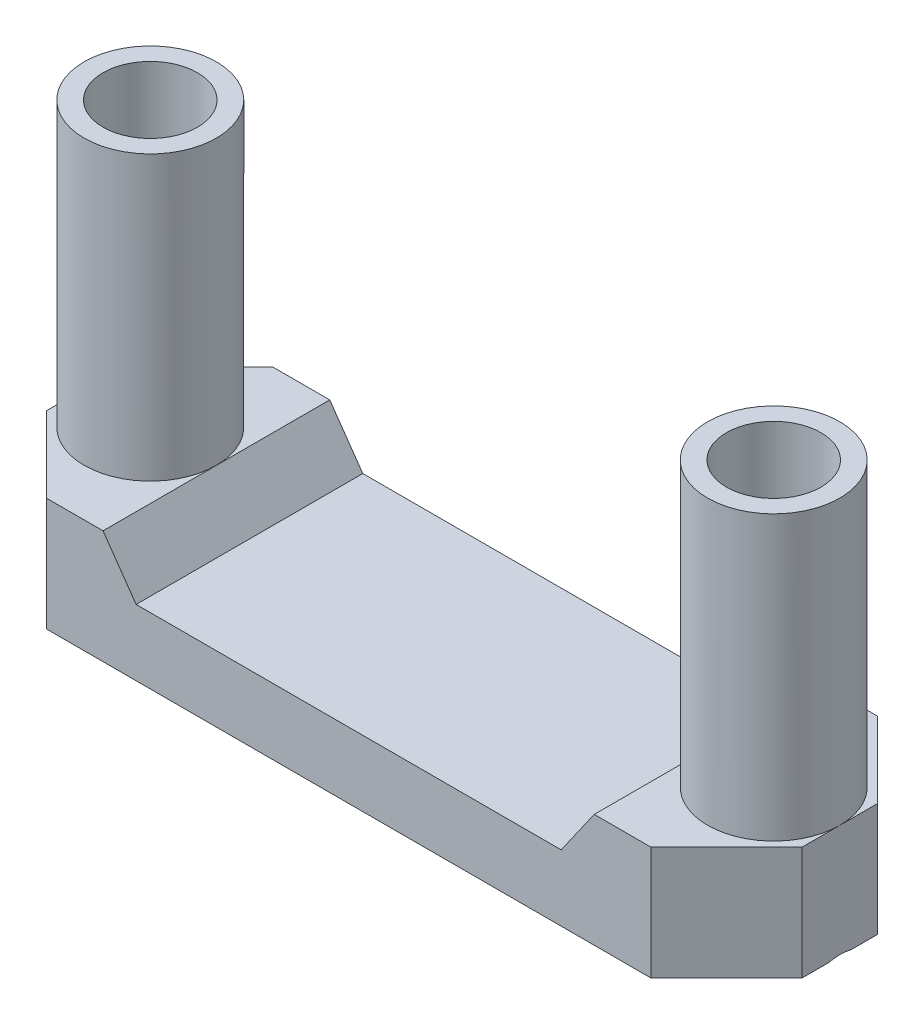
ISO-10303-21;
HEADER;
FILE_DESCRIPTION(('STEP AP214'),'2;1');
FILE_NAME('part.step','',(''),(''),'','','');
FILE_SCHEMA(('AUTOMOTIVE_DESIGN { 1 0 10303 214 1 1 1 1 }'));
ENDSEC;
DATA;
#1=APPLICATION_CONTEXT('core data for automotive mechanical design processes');
#2=APPLICATION_PROTOCOL_DEFINITION('international standard','automotive_design',2000,#1);
#3=PRODUCT_CONTEXT('',#1,'mechanical');
#4=PRODUCT('Part','Part','',(#3));
#5=PRODUCT_RELATED_PRODUCT_CATEGORY('part','',(#4));
#6=PRODUCT_DEFINITION_FORMATION('','',#4);
#7=PRODUCT_DEFINITION_CONTEXT('part definition',#1,'design');
#8=PRODUCT_DEFINITION('design','',#6,#7);
#9=PRODUCT_DEFINITION_SHAPE('','',#8);
#10=(LENGTH_UNIT() NAMED_UNIT(*) SI_UNIT(.MILLI.,.METRE.));
#11=(NAMED_UNIT(*) PLANE_ANGLE_UNIT() SI_UNIT($,.RADIAN.));
#12=(NAMED_UNIT(*) SI_UNIT($,.STERADIAN.) SOLID_ANGLE_UNIT());
#13=UNCERTAINTY_MEASURE_WITH_UNIT(LENGTH_MEASURE(1.E-05),#10,'distance_accuracy_value','');
#14=(GEOMETRIC_REPRESENTATION_CONTEXT(3) GLOBAL_UNCERTAINTY_ASSIGNED_CONTEXT((#13)) GLOBAL_UNIT_ASSIGNED_CONTEXT((#10,
#11,#12)) REPRESENTATION_CONTEXT('',''));
#15=CARTESIAN_POINT('',(0.,0.,0.));
#16=DIRECTION('',(0.,0.,1.));
#17=DIRECTION('',(1.,0.,0.));
#18=AXIS2_PLACEMENT_3D('',#15,#16,#17);
#19=CARTESIAN_POINT('',(0.,3.,0.));
#20=DIRECTION('',(0.,-1.,0.));
#21=DIRECTION('',(0.,0.,-1.));
#22=AXIS2_PLACEMENT_3D('',#19,#20,#21);
#23=PLANE('',#22);
#24=DIRECTION('',(0.,0.,-1.));
#25=VECTOR('',#24,1.);
#26=CARTESIAN_POINT('',(10.,3.,3.));
#27=LINE('',#26,#25);
#28=CARTESIAN_POINT('',(10.,3.,1.));
#29=VERTEX_POINT('',#28);
#30=CARTESIAN_POINT('',(10.,3.,0.));
#31=VERTEX_POINT('',#30);
#32=EDGE_CURVE('E176',#29,#31,#27,.T.);
#33=ORIENTED_EDGE('',*,*,#32,.T.);
#34=CARTESIAN_POINT('',(8.24999999999999,3.,0.));
#35=DIRECTION('',(0.,-1.,0.));
#36=DIRECTION('',(0.,0.,1.));
#37=AXIS2_PLACEMENT_3D('',#34,#35,#36);
#38=CIRCLE('',#37,1.75);
#39=CARTESIAN_POINT('',(6.5,3.,0.));
#40=VERTEX_POINT('',#39);
#41=EDGE_CURVE('E163',#31,#40,#38,.T.);
#42=ORIENTED_EDGE('',*,*,#41,.T.);
#43=DIRECTION('',(0.,0.,-1.));
#44=VECTOR('',#43,1.);
#45=CARTESIAN_POINT('',(6.5,3.,3.));
#46=LINE('',#45,#44);
#47=CARTESIAN_POINT('',(6.5,3.,3.));
#48=VERTEX_POINT('',#47);
#49=EDGE_CURVE('E174',#48,#40,#46,.T.);
#50=ORIENTED_EDGE('',*,*,#49,.F.);
#51=DIRECTION('',(1.,0.,0.));
#52=VECTOR('',#51,1.);
#53=CARTESIAN_POINT('',(-9.99999999999999,3.,3.));
#54=LINE('',#53,#52);
#55=CARTESIAN_POINT('',(8.,3.,3.));
#56=VERTEX_POINT('',#55);
#57=EDGE_CURVE('E213',#48,#56,#54,.T.);
#58=ORIENTED_EDGE('',*,*,#57,.T.);
#59=DIRECTION('',(-0.707106781186549,0.,0.707106781186546));
#60=VECTOR('',#59,1.);
#61=CARTESIAN_POINT('',(10.,3.,1.));
#62=LINE('',#61,#60);
#63=EDGE_CURVE('E265',#56,#29,#62,.F.);
#64=ORIENTED_EDGE('',*,*,#63,.T.);
#65=EDGE_LOOP('',(#33,#42,#50,#58,#64));
#66=FACE_BOUND('',#65,.T.);
#67=ADVANCED_FACE('F45',(#66),#23,.F.);
#68=CARTESIAN_POINT('',(-8.24999999999999,3.,0.));
#69=DIRECTION('',(0.,1.,0.));
#70=DIRECTION('',(0.,0.,1.));
#71=AXIS2_PLACEMENT_3D('',#68,#69,#70);
#72=CIRCLE('',#71,1.75);
#73=CARTESIAN_POINT('',(-9.99999999999999,3.,0.));
#74=VERTEX_POINT('',#73);
#75=CARTESIAN_POINT('',(-6.5,3.,0.));
#76=VERTEX_POINT('',#75);
#77=EDGE_CURVE('E385',#74,#76,#72,.T.);
#78=ORIENTED_EDGE('',*,*,#77,.F.);
#79=DIRECTION('',(0.,0.,1.));
#80=VECTOR('',#79,1.);
#81=CARTESIAN_POINT('',(-9.99999999999999,3.,3.));
#82=LINE('',#81,#80);
#83=CARTESIAN_POINT('',(-9.99999999999999,3.,0.999999999999991));
#84=VERTEX_POINT('',#83);
#85=EDGE_CURVE('E209',#74,#84,#82,.T.);
#86=ORIENTED_EDGE('',*,*,#85,.T.);
#87=DIRECTION('',(-0.707106781186546,0.,-0.707106781186549));
#88=VECTOR('',#87,1.);
#89=CARTESIAN_POINT('',(-7.99999999999999,3.,3.));
#90=LINE('',#89,#88);
#91=CARTESIAN_POINT('',(-7.99999999999999,3.,3.));
#92=VERTEX_POINT('',#91);
#93=EDGE_CURVE('E286',#84,#92,#90,.F.);
#94=ORIENTED_EDGE('',*,*,#93,.T.);
#95=CARTESIAN_POINT('',(-6.5,3.,3.));
#96=VERTEX_POINT('',#95);
#97=EDGE_CURVE('E214',#92,#96,#54,.T.);
#98=ORIENTED_EDGE('',*,*,#97,.T.);
#99=DIRECTION('',(0.,0.,1.));
#100=VECTOR('',#99,1.);
#101=CARTESIAN_POINT('',(-6.5,3.,3.));
#102=LINE('',#101,#100);
#103=EDGE_CURVE('E192',#76,#96,#102,.T.);
#104=ORIENTED_EDGE('',*,*,#103,.F.);
#105=EDGE_LOOP('',(#78,#86,#94,#98,#104));
#106=FACE_BOUND('',#105,.T.);
#107=ADVANCED_FACE('F361',(#106),#23,.F.);
#108=EDGE_CURVE('E376',#76,#74,#72,.T.);
#109=ORIENTED_EDGE('',*,*,#108,.F.);
#110=CARTESIAN_POINT('',(-6.5,3.,-3.));
#111=VERTEX_POINT('',#110);
#112=EDGE_CURVE('E194',#111,#76,#102,.T.);
#113=ORIENTED_EDGE('',*,*,#112,.F.);
#114=DIRECTION('',(-1.,0.,0.));
#115=VECTOR('',#114,1.);
#116=CARTESIAN_POINT('',(-9.99999999999999,3.,-3.));
#117=LINE('',#116,#115);
#118=CARTESIAN_POINT('',(-7.99999999999999,3.,-3.));
#119=VERTEX_POINT('',#118);
#120=EDGE_CURVE('E205',#111,#119,#117,.T.);
#121=ORIENTED_EDGE('',*,*,#120,.T.);
#122=DIRECTION('',(0.707106781186549,0.,-0.707106781186546));
#123=VECTOR('',#122,1.);
#124=CARTESIAN_POINT('',(-9.99999999999999,3.,-1.));
#125=LINE('',#124,#123);
#126=CARTESIAN_POINT('',(-9.99999999999999,3.,-1.));
#127=VERTEX_POINT('',#126);
#128=EDGE_CURVE('E289',#119,#127,#125,.F.);
#129=ORIENTED_EDGE('',*,*,#128,.T.);
#130=EDGE_CURVE('E210',#127,#74,#82,.T.);
#131=ORIENTED_EDGE('',*,*,#130,.T.);
#132=EDGE_LOOP('',(#109,#113,#121,#129,#131));
#133=FACE_BOUND('',#132,.T.);
#134=ADVANCED_FACE('F363',(#133),#23,.F.);
#135=CARTESIAN_POINT('',(6.5,3.,-3.));
#136=VERTEX_POINT('',#135);
#137=EDGE_CURVE('E181',#40,#136,#46,.T.);
#138=ORIENTED_EDGE('',*,*,#137,.F.);
#139=EDGE_CURVE('E160',#40,#31,#38,.T.);
#140=ORIENTED_EDGE('',*,*,#139,.T.);
#141=CARTESIAN_POINT('',(10.,3.,-0.999999999999995));
#142=VERTEX_POINT('',#141);
#143=EDGE_CURVE('E206',#31,#142,#27,.T.);
#144=ORIENTED_EDGE('',*,*,#143,.T.);
#145=DIRECTION('',(0.707106781186546,0.,0.707106781186549));
#146=VECTOR('',#145,1.);
#147=CARTESIAN_POINT('',(8.00000000000001,3.,-3.));
#148=LINE('',#147,#146);
#149=CARTESIAN_POINT('',(8.00000000000001,3.,-3.));
#150=VERTEX_POINT('',#149);
#151=EDGE_CURVE('E268',#142,#150,#148,.F.);
#152=ORIENTED_EDGE('',*,*,#151,.T.);
#153=EDGE_CURVE('E184',#150,#136,#117,.T.);
#154=ORIENTED_EDGE('',*,*,#153,.T.);
#155=EDGE_LOOP('',(#138,#140,#144,#152,#154));
#156=FACE_BOUND('',#155,.T.);
#157=ADVANCED_FACE('F182',(#156),#23,.F.);
#158=CARTESIAN_POINT('',(0.,0.,0.));
#159=DIRECTION('',(0.,-1.,0.));
#160=DIRECTION('',(0.,0.,-1.));
#161=AXIS2_PLACEMENT_3D('',#158,#159,#160);
#162=PLANE('',#161);
#163=DIRECTION('',(0.,0.,-1.));
#164=VECTOR('',#163,1.);
#165=CARTESIAN_POINT('',(10.,0.,3.));
#166=LINE('',#165,#164);
#167=CARTESIAN_POINT('',(10.,0.,-0.297787835062796));
#168=VERTEX_POINT('',#167);
#169=CARTESIAN_POINT('',(10.,0.,-0.999999999999995));
#170=VERTEX_POINT('',#169);
#171=EDGE_CURVE('E224',#168,#170,#166,.T.);
#172=ORIENTED_EDGE('',*,*,#171,.F.);
#173=CARTESIAN_POINT('',(8.24999999999999,0.,0.));
#174=DIRECTION('',(0.,-1.,0.));
#175=DIRECTION('',(0.,0.,-1.));
#176=AXIS2_PLACEMENT_3D('',#173,#174,#175);
#177=CIRCLE('',#176,1.77515565365729);
#178=CARTESIAN_POINT('',(10.,0.,0.297787835062796));
#179=VERTEX_POINT('',#178);
#180=EDGE_CURVE('E296',#168,#179,#177,.F.);
#181=ORIENTED_EDGE('',*,*,#180,.T.);
#182=CARTESIAN_POINT('',(10.,0.,1.));
#183=VERTEX_POINT('',#182);
#184=EDGE_CURVE('E219',#183,#179,#166,.T.);
#185=ORIENTED_EDGE('',*,*,#184,.F.);
#186=DIRECTION('',(0.707106781186549,0.,-0.707106781186546));
#187=VECTOR('',#186,1.);
#188=CARTESIAN_POINT('',(5.49999999999999,0.,5.50000000000001));
#189=LINE('',#188,#187);
#190=CARTESIAN_POINT('',(8.,0.,3.));
#191=VERTEX_POINT('',#190);
#192=EDGE_CURVE('E250',#183,#191,#189,.F.);
#193=ORIENTED_EDGE('',*,*,#192,.T.);
#194=DIRECTION('',(1.,0.,0.));
#195=VECTOR('',#194,1.);
#196=CARTESIAN_POINT('',(-9.99999999999999,0.,3.));
#197=LINE('',#196,#195);
#198=CARTESIAN_POINT('',(-7.99999999999999,0.,3.));
#199=VERTEX_POINT('',#198);
#200=EDGE_CURVE('E233',#199,#191,#197,.T.);
#201=ORIENTED_EDGE('',*,*,#200,.F.);
#202=DIRECTION('',(0.707106781186546,0.,0.707106781186549));
#203=VECTOR('',#202,1.);
#204=CARTESIAN_POINT('',(-5.50000000000001,0.,5.49999999999999));
#205=LINE('',#204,#203);
#206=CARTESIAN_POINT('',(-9.99999999999999,0.,0.999999999999991));
#207=VERTEX_POINT('',#206);
#208=EDGE_CURVE('E243',#199,#207,#205,.F.);
#209=ORIENTED_EDGE('',*,*,#208,.T.);
#210=DIRECTION('',(0.,0.,1.));
#211=VECTOR('',#210,1.);
#212=CARTESIAN_POINT('',(-9.99999999999999,0.,3.));
#213=LINE('',#212,#211);
#214=CARTESIAN_POINT('',(-9.99999999999999,0.,0.297787835062857));
#215=VERTEX_POINT('',#214);
#216=EDGE_CURVE('E228',#215,#207,#213,.T.);
#217=ORIENTED_EDGE('',*,*,#216,.F.);
#218=CARTESIAN_POINT('',(-8.24999999999999,0.,0.));
#219=DIRECTION('',(0.,-1.,0.));
#220=DIRECTION('',(0.,0.,-1.));
#221=AXIS2_PLACEMENT_3D('',#218,#219,#220);
#222=CIRCLE('',#221,1.77515565365729);
#223=CARTESIAN_POINT('',(-9.99999999999999,0.,-0.297787835062857));
#224=VERTEX_POINT('',#223);
#225=EDGE_CURVE('E292',#215,#224,#222,.F.);
#226=ORIENTED_EDGE('',*,*,#225,.T.);
#227=CARTESIAN_POINT('',(-9.99999999999999,0.,-1.));
#228=VERTEX_POINT('',#227);
#229=EDGE_CURVE('E229',#228,#224,#213,.T.);
#230=ORIENTED_EDGE('',*,*,#229,.F.);
#231=DIRECTION('',(-0.707106781186549,0.,0.707106781186546));
#232=VECTOR('',#231,1.);
#233=CARTESIAN_POINT('',(-5.49999999999998,0.,-5.5));
#234=LINE('',#233,#232);
#235=CARTESIAN_POINT('',(-7.99999999999999,0.,-3.));
#236=VERTEX_POINT('',#235);
#237=EDGE_CURVE('E247',#228,#236,#234,.F.);
#238=ORIENTED_EDGE('',*,*,#237,.T.);
#239=DIRECTION('',(-1.,0.,0.));
#240=VECTOR('',#239,1.);
#241=CARTESIAN_POINT('',(-9.99999999999999,0.,-3.));
#242=LINE('',#241,#240);
#243=CARTESIAN_POINT('',(8.00000000000001,0.,-3.));
#244=VERTEX_POINT('',#243);
#245=EDGE_CURVE('E223',#244,#236,#242,.T.);
#246=ORIENTED_EDGE('',*,*,#245,.F.);
#247=DIRECTION('',(-0.707106781186546,0.,-0.707106781186549));
#248=VECTOR('',#247,1.);
#249=CARTESIAN_POINT('',(5.50000000000002,0.,-5.5));
#250=LINE('',#249,#248);
#251=EDGE_CURVE('E253',#244,#170,#250,.F.);
#252=ORIENTED_EDGE('',*,*,#251,.T.);
#253=EDGE_LOOP('',(#172,#181,#185,#193,#201,#209,#217,#226,#230,#238,#246,#252));
#254=FACE_BOUND('',#253,.T.);
#255=ADVANCED_FACE('F322',(#254),#162,.T.);
#256=CARTESIAN_POINT('',(10.,3.,3.));
#257=DIRECTION('',(-1.,0.,0.));
#258=DIRECTION('',(0.,0.,1.));
#259=AXIS2_PLACEMENT_3D('',#256,#257,#258);
#260=PLANE('',#259);
#261=ORIENTED_EDGE('',*,*,#184,.T.);
#262=CARTESIAN_POINT('',(10.,0.,0.297787835062796));
#263=CARTESIAN_POINT('',(10.,0.00847021622235897,0.262514740838788));
#264=CARTESIAN_POINT('',(10.,0.0155279991265539,0.226887335278827));
#265=CARTESIAN_POINT('',(10.,0.0266353072208699,0.155146478289268));
#266=CARTESIAN_POINT('',(10.,0.0306829976430174,0.119032744053447));
#267=CARTESIAN_POINT('',(10.,0.035527126517681,0.0473083585190543));
#268=CARTESIAN_POINT('',(10.,0.036386844468547,0.0117020525783002));
#269=CARTESIAN_POINT('',(10.,0.0350004595362756,-0.0594279350068016));
#270=CARTESIAN_POINT('',(10.,0.0327563518654278,-0.094951655039672));
#271=CARTESIAN_POINT('',(10.,0.0260291265855819,-0.158388376737417));
#272=CARTESIAN_POINT('',(10.,0.0221021635481871,-0.186362395284557));
#273=CARTESIAN_POINT('',(10.,0.0124131845226319,-0.242225274447756));
#274=CARTESIAN_POINT('',(10.,0.006636562138615,-0.270111609874269));
#275=CARTESIAN_POINT('',(10.,0.,-0.297787835062796));
#276=B_SPLINE_CURVE_WITH_KNOTS('',3,(#262,#263,#264,#265,#266,#267,#268,#269,#270,#271,#272,
#273,#274,#275),.UNSPECIFIED.,.F.,.F.,(4,2,2,2,2,2,4),(0.,0.108821248837717,0.217708774196028,
0.324423006209307,0.431068671671564,0.515755862889547,0.601129025854218),.UNSPECIFIED.);
#277=EDGE_CURVE('E300',#179,#168,#276,.T.);
#278=ORIENTED_EDGE('',*,*,#277,.T.);
#279=ORIENTED_EDGE('',*,*,#171,.T.);
#280=DIRECTION('',(0.,1.,0.));
#281=VECTOR('',#280,1.);
#282=CARTESIAN_POINT('',(10.,3.,-0.999999999999995));
#283=LINE('',#282,#281);
#284=EDGE_CURVE('E261',#170,#142,#283,.T.);
#285=ORIENTED_EDGE('',*,*,#284,.T.);
#286=ORIENTED_EDGE('',*,*,#143,.F.);
#287=ORIENTED_EDGE('',*,*,#32,.F.);
#288=DIRECTION('',(0.,-1.,0.));
#289=VECTOR('',#288,1.);
#290=CARTESIAN_POINT('',(10.,3.,1.));
#291=LINE('',#290,#289);
#292=EDGE_CURVE('E257',#29,#183,#291,.T.);
#293=ORIENTED_EDGE('',*,*,#292,.T.);
#294=EDGE_LOOP('',(#261,#278,#279,#285,#286,#287,#293));
#295=FACE_BOUND('',#294,.T.);
#296=ADVANCED_FACE('F316',(#295),#260,.F.);
#297=CARTESIAN_POINT('',(-9.99999999999999,3.,-3.));
#298=DIRECTION('',(0.,0.,1.));
#299=DIRECTION('',(1.,0.,0.));
#300=AXIS2_PLACEMENT_3D('',#297,#298,#299);
#301=PLANE('',#300);
#302=ORIENTED_EDGE('',*,*,#153,.F.);
#303=DIRECTION('',(0.,-1.,0.));
#304=VECTOR('',#303,1.);
#305=CARTESIAN_POINT('',(8.00000000000001,3.,-3.));
#306=LINE('',#305,#304);
#307=EDGE_CURVE('E239',#150,#244,#306,.T.);
#308=ORIENTED_EDGE('',*,*,#307,.T.);
#309=ORIENTED_EDGE('',*,*,#245,.T.);
#310=DIRECTION('',(0.,1.,0.));
#311=VECTOR('',#310,1.);
#312=CARTESIAN_POINT('',(-7.99999999999999,3.,-3.));
#313=LINE('',#312,#311);
#314=EDGE_CURVE('E218',#236,#119,#313,.T.);
#315=ORIENTED_EDGE('',*,*,#314,.T.);
#316=ORIENTED_EDGE('',*,*,#120,.F.);
#317=DIRECTION('',(-0.57357643635105,0.819152044288989,0.));
#318=VECTOR('',#317,1.);
#319=CARTESIAN_POINT('',(-7.6514647491801,4.64446208637534,-3.));
#320=LINE('',#319,#318);
#321=CARTESIAN_POINT('',(-5.62474057723786,1.75,-3.));
#322=VERTEX_POINT('',#321);
#323=EDGE_CURVE('E11',#111,#322,#320,.F.);
#324=ORIENTED_EDGE('',*,*,#323,.T.);
#325=DIRECTION('',(-1.,0.,0.));
#326=VECTOR('',#325,1.);
#327=CARTESIAN_POINT('',(-6.5,1.75,-3.));
#328=LINE('',#327,#326);
#329=CARTESIAN_POINT('',(5.62474057723786,1.75,-3.));
#330=VERTEX_POINT('',#329);
#331=EDGE_CURVE('E202',#330,#322,#328,.T.);
#332=ORIENTED_EDGE('',*,*,#331,.F.);
#333=DIRECTION('',(-0.57357643635105,-0.819152044288989,0.));
#334=VECTOR('',#333,1.);
#335=CARTESIAN_POINT('',(1.0716661824367,-4.75246412148377,-3.));
#336=LINE('',#335,#334);
#337=EDGE_CURVE('E696',#330,#136,#336,.F.);
#338=ORIENTED_EDGE('',*,*,#337,.T.);
#339=EDGE_LOOP('',(#302,#308,#309,#315,#316,#324,#332,#338));
#340=FACE_BOUND('',#339,.T.);
#341=ADVANCED_FACE('F321',(#340),#301,.F.);
#342=CARTESIAN_POINT('',(-9.99999999999999,3.,3.));
#343=DIRECTION('',(1.,0.,0.));
#344=DIRECTION('',(0.,0.,-1.));
#345=AXIS2_PLACEMENT_3D('',#342,#343,#344);
#346=PLANE('',#345);
#347=ORIENTED_EDGE('',*,*,#229,.T.);
#348=CARTESIAN_POINT('',(-9.99999999999999,0.,-0.297787835062857));
#349=CARTESIAN_POINT('',(-9.99999999999999,0.00847021622236053,-0.262514740838849));
#350=CARTESIAN_POINT('',(-9.99999999999999,0.0155279991265572,-0.226887335278887));
#351=CARTESIAN_POINT('',(-9.99999999999999,0.0266353072208771,-0.155146478289328));
#352=CARTESIAN_POINT('',(-9.99999999999999,0.0306829976430265,-0.119032744053507));
#353=CARTESIAN_POINT('',(-9.99999999999999,0.0355271265176935,-0.047308358519114));
#354=CARTESIAN_POINT('',(-9.99999999999999,0.0363868444685611,-0.0117020525783596));
#355=CARTESIAN_POINT('',(-9.99999999999999,0.0350004595362931,0.0594279350067428));
#356=CARTESIAN_POINT('',(-9.99999999999999,0.0327563518654472,0.0949516550396137));
#357=CARTESIAN_POINT('',(-9.99999999999999,0.0260291265856022,0.15838837673738));
#358=CARTESIAN_POINT('',(-9.99999999999999,0.0221021635482052,0.186362395284539));
#359=CARTESIAN_POINT('',(-9.99999999999999,0.0124131845226429,0.242225274447778));
#360=CARTESIAN_POINT('',(-9.99999999999999,0.00663656213862108,0.270111609874311));
#361=CARTESIAN_POINT('',(-9.99999999999999,0.,0.297787835062857));
#362=B_SPLINE_CURVE_WITH_KNOTS('',3,(#348,#349,#350,#351,#352,#353,#354,#355,#356,#357,#358,
#359,#360,#361),.UNSPECIFIED.,.F.,.F.,(4,2,2,2,2,2,4),(0.,0.108821248837718,0.217708774196031,
0.324423006209311,0.431068671671568,0.515755862889611,0.601129025854344),.UNSPECIFIED.);
#363=EDGE_CURVE('E466',#224,#215,#362,.T.);
#364=ORIENTED_EDGE('',*,*,#363,.T.);
#365=ORIENTED_EDGE('',*,*,#216,.T.);
#366=DIRECTION('',(0.,1.,0.));
#367=VECTOR('',#366,1.);
#368=CARTESIAN_POINT('',(-9.99999999999999,3.,0.999999999999991));
#369=LINE('',#368,#367);
#370=EDGE_CURVE('E278',#207,#84,#369,.T.);
#371=ORIENTED_EDGE('',*,*,#370,.T.);
#372=ORIENTED_EDGE('',*,*,#85,.F.);
#373=ORIENTED_EDGE('',*,*,#130,.F.);
#374=DIRECTION('',(0.,-1.,0.));
#375=VECTOR('',#374,1.);
#376=CARTESIAN_POINT('',(-9.99999999999999,3.,-1.));
#377=LINE('',#376,#375);
#378=EDGE_CURVE('E282',#127,#228,#377,.T.);
#379=ORIENTED_EDGE('',*,*,#378,.T.);
#380=EDGE_LOOP('',(#347,#364,#365,#371,#372,#373,#379));
#381=FACE_BOUND('',#380,.T.);
#382=ADVANCED_FACE('F480',(#381),#346,.F.);
#383=CARTESIAN_POINT('',(-9.99999999999999,3.,3.));
#384=DIRECTION('',(0.,0.,-1.));
#385=DIRECTION('',(-1.,0.,0.));
#386=AXIS2_PLACEMENT_3D('',#383,#384,#385);
#387=PLANE('',#386);
#388=ORIENTED_EDGE('',*,*,#200,.T.);
#389=DIRECTION('',(0.,1.,0.));
#390=VECTOR('',#389,1.);
#391=CARTESIAN_POINT('',(8.,3.,3.));
#392=LINE('',#391,#390);
#393=EDGE_CURVE('E275',#191,#56,#392,.T.);
#394=ORIENTED_EDGE('',*,*,#393,.T.);
#395=ORIENTED_EDGE('',*,*,#57,.F.);
#396=DIRECTION('',(0.57357643635105,0.819152044288989,0.));
#397=VECTOR('',#396,1.);
#398=CARTESIAN_POINT('',(1.0716661824367,-4.75246412148377,3.));
#399=LINE('',#398,#397);
#400=CARTESIAN_POINT('',(5.62474057723786,1.75,3.));
#401=VERTEX_POINT('',#400);
#402=EDGE_CURVE('E62',#48,#401,#399,.F.);
#403=ORIENTED_EDGE('',*,*,#402,.T.);
#404=DIRECTION('',(1.,0.,0.));
#405=VECTOR('',#404,1.);
#406=CARTESIAN_POINT('',(-6.5,1.75,3.));
#407=LINE('',#406,#405);
#408=CARTESIAN_POINT('',(-5.62474057723786,1.75,3.));
#409=VERTEX_POINT('',#408);
#410=EDGE_CURVE('E197',#409,#401,#407,.T.);
#411=ORIENTED_EDGE('',*,*,#410,.F.);
#412=DIRECTION('',(0.57357643635105,-0.819152044288989,0.));
#413=VECTOR('',#412,1.);
#414=CARTESIAN_POINT('',(-7.6514647491801,4.64446208637534,3.));
#415=LINE('',#414,#413);
#416=EDGE_CURVE('E55',#409,#96,#415,.F.);
#417=ORIENTED_EDGE('',*,*,#416,.T.);
#418=ORIENTED_EDGE('',*,*,#97,.F.);
#419=DIRECTION('',(0.,-1.,0.));
#420=VECTOR('',#419,1.);
#421=CARTESIAN_POINT('',(-7.99999999999999,3.,3.));
#422=LINE('',#421,#420);
#423=EDGE_CURVE('E271',#92,#199,#422,.T.);
#424=ORIENTED_EDGE('',*,*,#423,.T.);
#425=EDGE_LOOP('',(#388,#394,#395,#403,#411,#417,#418,#424));
#426=FACE_BOUND('',#425,.T.);
#427=ADVANCED_FACE('F428',(#426),#387,.F.);
#428=CARTESIAN_POINT('',(-8.24999999999999,3.,0.));
#429=DIRECTION('',(0.,-1.,0.));
#430=DIRECTION('',(0.,0.,-1.));
#431=AXIS2_PLACEMENT_3D('',#428,#429,#430);
#432=CYLINDRICAL_SURFACE('',#431,1.25);
#433=CARTESIAN_POINT('',(-8.24999999999999,0.750000000000006,0.));
#434=DIRECTION('',(0.,-1.,0.));
#435=DIRECTION('',(0.,0.,-1.));
#436=AXIS2_PLACEMENT_3D('',#433,#434,#435);
#437=CIRCLE('',#436,1.25);
#438=CARTESIAN_POINT('',(-8.24999999999999,0.750000000000006,-1.25));
#439=VERTEX_POINT('',#438);
#440=EDGE_CURVE('E468',#439,#439,#437,.T.);
#441=ORIENTED_EDGE('',*,*,#440,.T.);
#442=EDGE_LOOP('',(#441));
#443=FACE_BOUND('',#442,.T.);
#444=CARTESIAN_POINT('',(-8.24999999999999,10.5,0.));
#445=DIRECTION('',(0.,1.,0.));
#446=DIRECTION('',(0.,0.,1.));
#447=AXIS2_PLACEMENT_3D('',#444,#445,#446);
#448=CIRCLE('',#447,1.25);
#449=CARTESIAN_POINT('',(-8.24999999999999,10.5,1.25));
#450=VERTEX_POINT('',#449);
#451=EDGE_CURVE('E390',#450,#450,#448,.T.);
#452=ORIENTED_EDGE('',*,*,#451,.T.);
#453=EDGE_LOOP('',(#452));
#454=FACE_BOUND('',#453,.T.);
#455=ADVANCED_FACE('F420',(#443,#454),#432,.F.);
#456=CARTESIAN_POINT('',(8.24999999999999,3.,0.));
#457=DIRECTION('',(0.,-1.,0.));
#458=DIRECTION('',(0.,0.,-1.));
#459=AXIS2_PLACEMENT_3D('',#456,#457,#458);
#460=CYLINDRICAL_SURFACE('',#459,1.25);
#461=CARTESIAN_POINT('',(8.24999999999999,0.750000000000007,0.));
#462=DIRECTION('',(0.,-1.,0.));
#463=DIRECTION('',(0.,0.,-1.));
#464=AXIS2_PLACEMENT_3D('',#461,#462,#463);
#465=CIRCLE('',#464,1.25);
#466=CARTESIAN_POINT('',(8.24999999999999,0.750000000000007,-1.25));
#467=VERTEX_POINT('',#466);
#468=EDGE_CURVE('E309',#467,#467,#465,.T.);
#469=ORIENTED_EDGE('',*,*,#468,.T.);
#470=EDGE_LOOP('',(#469));
#471=FACE_BOUND('',#470,.T.);
#472=CARTESIAN_POINT('',(8.24999999999999,10.5,0.));
#473=DIRECTION('',(0.,-1.,0.));
#474=DIRECTION('',(0.,0.,1.));
#475=AXIS2_PLACEMENT_3D('',#472,#473,#474);
#476=CIRCLE('',#475,1.25);
#477=CARTESIAN_POINT('',(8.24999999999999,10.5,1.25));
#478=VERTEX_POINT('',#477);
#479=EDGE_CURVE('E178',#478,#478,#476,.T.);
#480=ORIENTED_EDGE('',*,*,#479,.F.);
#481=EDGE_LOOP('',(#480));
#482=FACE_BOUND('',#481,.T.);
#483=ADVANCED_FACE('F418',(#471,#482),#460,.F.);
#484=CARTESIAN_POINT('',(0.,1.75,0.));
#485=DIRECTION('',(0.,-1.,0.));
#486=DIRECTION('',(0.,0.,-1.));
#487=AXIS2_PLACEMENT_3D('',#484,#485,#486);
#488=PLANE('',#487);
#489=ORIENTED_EDGE('',*,*,#410,.T.);
#490=DIRECTION('',(0.,0.,-1.));
#491=VECTOR('',#490,1.);
#492=CARTESIAN_POINT('',(5.62474057723786,1.75,-3.));
#493=LINE('',#492,#491);
#494=EDGE_CURVE('E398',#401,#330,#493,.T.);
#495=ORIENTED_EDGE('',*,*,#494,.T.);
#496=ORIENTED_EDGE('',*,*,#331,.T.);
#497=DIRECTION('',(0.,0.,1.));
#498=VECTOR('',#497,1.);
#499=CARTESIAN_POINT('',(-5.62474057723786,1.75,3.));
#500=LINE('',#499,#498);
#501=EDGE_CURVE('E392',#322,#409,#500,.T.);
#502=ORIENTED_EDGE('',*,*,#501,.T.);
#503=EDGE_LOOP('',(#489,#495,#496,#502));
#504=FACE_BOUND('',#503,.T.);
#505=ADVANCED_FACE('F333',(#504),#488,.F.);
#506=CARTESIAN_POINT('',(8.00000000000001,3.,-3.));
#507=DIRECTION('',(-0.707106781186549,0.,0.707106781186546));
#508=DIRECTION('',(0.,-1.,0.));
#509=AXIS2_PLACEMENT_3D('',#506,#507,#508);
#510=PLANE('',#509);
#511=ORIENTED_EDGE('',*,*,#151,.F.);
#512=ORIENTED_EDGE('',*,*,#284,.F.);
#513=ORIENTED_EDGE('',*,*,#251,.F.);
#514=ORIENTED_EDGE('',*,*,#307,.F.);
#515=EDGE_LOOP('',(#511,#512,#513,#514));
#516=FACE_BOUND('',#515,.T.);
#517=ADVANCED_FACE('F326',(#516),#510,.F.);
#518=CARTESIAN_POINT('',(10.,3.,1.));
#519=DIRECTION('',(-0.707106781186546,0.,-0.707106781186549));
#520=DIRECTION('',(0.,-1.,0.));
#521=AXIS2_PLACEMENT_3D('',#518,#519,#520);
#522=PLANE('',#521);
#523=ORIENTED_EDGE('',*,*,#63,.F.);
#524=ORIENTED_EDGE('',*,*,#393,.F.);
#525=ORIENTED_EDGE('',*,*,#192,.F.);
#526=ORIENTED_EDGE('',*,*,#292,.F.);
#527=EDGE_LOOP('',(#523,#524,#525,#526));
#528=FACE_BOUND('',#527,.T.);
#529=ADVANCED_FACE('F332',(#528),#522,.F.);
#530=CARTESIAN_POINT('',(-9.99999999999999,3.,-1.));
#531=DIRECTION('',(0.707106781186546,0.,0.707106781186549));
#532=DIRECTION('',(0.,-1.,0.));
#533=AXIS2_PLACEMENT_3D('',#530,#531,#532);
#534=PLANE('',#533);
#535=ORIENTED_EDGE('',*,*,#128,.F.);
#536=ORIENTED_EDGE('',*,*,#314,.F.);
#537=ORIENTED_EDGE('',*,*,#237,.F.);
#538=ORIENTED_EDGE('',*,*,#378,.F.);
#539=EDGE_LOOP('',(#535,#536,#537,#538));
#540=FACE_BOUND('',#539,.T.);
#541=ADVANCED_FACE('F340',(#540),#534,.F.);
#542=CARTESIAN_POINT('',(-7.99999999999999,3.,3.));
#543=DIRECTION('',(0.707106781186549,0.,-0.707106781186546));
#544=DIRECTION('',(0.,-1.,0.));
#545=AXIS2_PLACEMENT_3D('',#542,#543,#544);
#546=PLANE('',#545);
#547=ORIENTED_EDGE('',*,*,#93,.F.);
#548=ORIENTED_EDGE('',*,*,#370,.F.);
#549=ORIENTED_EDGE('',*,*,#208,.F.);
#550=ORIENTED_EDGE('',*,*,#423,.F.);
#551=EDGE_LOOP('',(#547,#548,#549,#550));
#552=FACE_BOUND('',#551,.T.);
#553=ADVANCED_FACE('F346',(#552),#546,.F.);
#554=CARTESIAN_POINT('',(-8.24999999999999,10.5,0.));
#555=DIRECTION('',(0.,1.,0.));
#556=DIRECTION('',(0.,0.,1.));
#557=AXIS2_PLACEMENT_3D('',#554,#555,#556);
#558=PLANE('',#557);
#559=CARTESIAN_POINT('',(-8.24999999999999,10.5,0.));
#560=DIRECTION('',(0.,1.,0.));
#561=DIRECTION('',(0.,0.,1.));
#562=AXIS2_PLACEMENT_3D('',#559,#560,#561);
#563=CIRCLE('',#562,1.75);
#564=CARTESIAN_POINT('',(-8.24999999999999,10.5,1.75));
#565=VERTEX_POINT('',#564);
#566=EDGE_CURVE('E187',#565,#565,#563,.T.);
#567=ORIENTED_EDGE('',*,*,#566,.T.);
#568=EDGE_LOOP('',(#567));
#569=FACE_BOUND('',#568,.T.);
#570=ORIENTED_EDGE('',*,*,#451,.F.);
#571=EDGE_LOOP('',(#570));
#572=FACE_BOUND('',#571,.T.);
#573=ADVANCED_FACE('F351',(#569,#572),#558,.T.);
#574=CARTESIAN_POINT('',(-8.24999999999999,10.5,0.));
#575=DIRECTION('',(0.,-1.,0.));
#576=DIRECTION('',(0.,0.,-1.));
#577=AXIS2_PLACEMENT_3D('',#574,#575,#576);
#578=CYLINDRICAL_SURFACE('',#577,1.75);
#579=ORIENTED_EDGE('',*,*,#566,.F.);
#580=EDGE_LOOP('',(#579));
#581=FACE_BOUND('',#580,.T.);
#582=ORIENTED_EDGE('',*,*,#108,.T.);
#583=ORIENTED_EDGE('',*,*,#77,.T.);
#584=EDGE_LOOP('',(#582,#583));
#585=FACE_BOUND('',#584,.T.);
#586=ADVANCED_FACE('F356',(#581,#585),#578,.T.);
#587=CARTESIAN_POINT('',(8.24999999999999,10.5,0.));
#588=DIRECTION('',(0.,-1.,0.));
#589=DIRECTION('',(0.,0.,-1.));
#590=AXIS2_PLACEMENT_3D('',#587,#588,#589);
#591=CYLINDRICAL_SURFACE('',#590,1.75);
#592=CARTESIAN_POINT('',(8.24999999999999,10.5,0.));
#593=DIRECTION('',(0.,-1.,0.));
#594=DIRECTION('',(0.,0.,1.));
#595=AXIS2_PLACEMENT_3D('',#592,#593,#594);
#596=CIRCLE('',#595,1.75);
#597=CARTESIAN_POINT('',(8.24999999999999,10.5,1.75));
#598=VERTEX_POINT('',#597);
#599=EDGE_CURVE('E168',#598,#598,#596,.T.);
#600=ORIENTED_EDGE('',*,*,#599,.T.);
#601=EDGE_LOOP('',(#600));
#602=FACE_BOUND('',#601,.T.);
#603=ORIENTED_EDGE('',*,*,#139,.F.);
#604=ORIENTED_EDGE('',*,*,#41,.F.);
#605=EDGE_LOOP('',(#603,#604));
#606=FACE_BOUND('',#605,.T.);
#607=ADVANCED_FACE('F162',(#602,#606),#591,.T.);
#608=CARTESIAN_POINT('',(8.24999999999999,10.5,0.));
#609=DIRECTION('',(0.,1.,0.));
#610=DIRECTION('',(0.,0.,1.));
#611=AXIS2_PLACEMENT_3D('',#608,#609,#610);
#612=PLANE('',#611);
#613=ORIENTED_EDGE('',*,*,#479,.T.);
#614=EDGE_LOOP('',(#613));
#615=FACE_BOUND('',#614,.T.);
#616=ORIENTED_EDGE('',*,*,#599,.F.);
#617=EDGE_LOOP('',(#616));
#618=FACE_BOUND('',#617,.T.);
#619=ADVANCED_FACE('F415',(#615,#618),#612,.T.);
#620=CARTESIAN_POINT('',(8.24999999999999,0.,0.));
#621=DIRECTION('',(0.,-1.,0.));
#622=DIRECTION('',(0.,0.,-1.));
#623=AXIS2_PLACEMENT_3D('',#620,#621,#622);
#624=CONICAL_SURFACE('',#623,1.77515565365729,0.610865238198014);
#625=ORIENTED_EDGE('',*,*,#468,.F.);
#626=EDGE_LOOP('',(#625));
#627=FACE_BOUND('',#626,.T.);
#628=ORIENTED_EDGE('',*,*,#277,.F.);
#629=ORIENTED_EDGE('',*,*,#180,.F.);
#630=EDGE_LOOP('',(#628,#629));
#631=FACE_BOUND('',#630,.T.);
#632=ADVANCED_FACE('F312',(#627,#631),#624,.F.);
#633=CARTESIAN_POINT('',(-8.24999999999999,0.,0.));
#634=DIRECTION('',(0.,-1.,0.));
#635=DIRECTION('',(0.,0.,-1.));
#636=AXIS2_PLACEMENT_3D('',#633,#634,#635);
#637=CONICAL_SURFACE('',#636,1.77515565365729,0.610865238198014);
#638=ORIENTED_EDGE('',*,*,#440,.F.);
#639=EDGE_LOOP('',(#638));
#640=FACE_BOUND('',#639,.T.);
#641=ORIENTED_EDGE('',*,*,#363,.F.);
#642=ORIENTED_EDGE('',*,*,#225,.F.);
#643=EDGE_LOOP('',(#641,#642));
#644=FACE_BOUND('',#643,.T.);
#645=ADVANCED_FACE('F442',(#640,#644),#637,.F.);
#646=CARTESIAN_POINT('',(5.62474057723786,1.75,0.));
#647=DIRECTION('',(-0.819152044288989,0.57357643635105,0.));
#648=DIRECTION('',(0.,0.,1.));
#649=AXIS2_PLACEMENT_3D('',#646,#647,#648);
#650=PLANE('',#649);
#651=ORIENTED_EDGE('',*,*,#49,.T.);
#652=ORIENTED_EDGE('',*,*,#137,.T.);
#653=ORIENTED_EDGE('',*,*,#337,.F.);
#654=ORIENTED_EDGE('',*,*,#494,.F.);
#655=ORIENTED_EDGE('',*,*,#402,.F.);
#656=EDGE_LOOP('',(#651,#652,#653,#654,#655));
#657=FACE_BOUND('',#656,.T.);
#658=ADVANCED_FACE('F189',(#657),#650,.T.);
#659=CARTESIAN_POINT('',(-5.62474057723786,1.75,0.));
#660=DIRECTION('',(0.819152044288989,0.57357643635105,0.));
#661=DIRECTION('',(0.,0.,-1.));
#662=AXIS2_PLACEMENT_3D('',#659,#660,#661);
#663=PLANE('',#662);
#664=ORIENTED_EDGE('',*,*,#112,.T.);
#665=ORIENTED_EDGE('',*,*,#103,.T.);
#666=ORIENTED_EDGE('',*,*,#416,.F.);
#667=ORIENTED_EDGE('',*,*,#501,.F.);
#668=ORIENTED_EDGE('',*,*,#323,.F.);
#669=EDGE_LOOP('',(#664,#665,#666,#667,#668));
#670=FACE_BOUND('',#669,.T.);
#671=ADVANCED_FACE('F48',(#670),#663,.T.);
#672=CLOSED_SHELL('',(#67,#107,#134,#157,#255,#296,#341,#382,#427,#455,#483,#505,#517,#529,#541,
#553,#573,#586,#607,#619,#632,#645,#658,#671));
#673=MANIFOLD_SOLID_BREP('B2',#672);
#674=ADVANCED_BREP_SHAPE_REPRESENTATION('',(#18,#673),#14);
#675=SHAPE_DEFINITION_REPRESENTATION(#9,#674);
ENDSEC;
END-ISO-10303-21;
